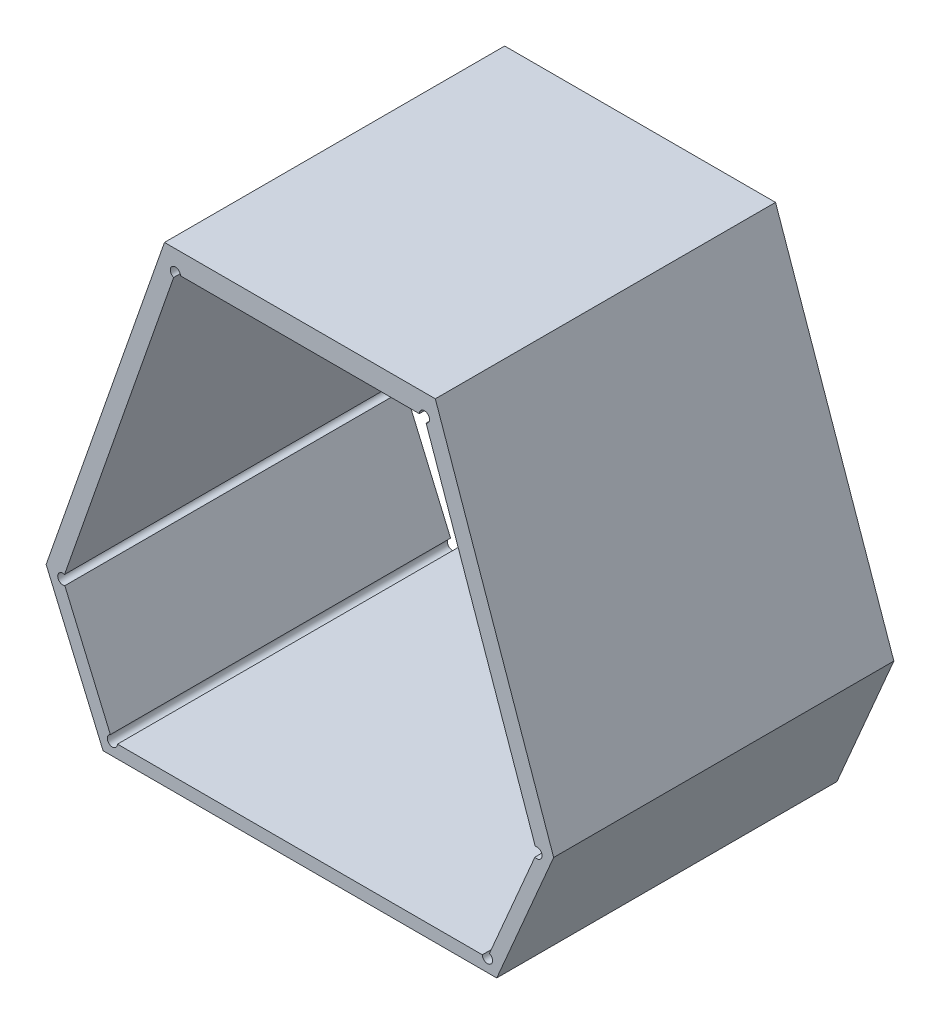
ISO-10303-21;
HEADER;
FILE_DESCRIPTION(('STEP AP214'),'2;1');
FILE_NAME('part.step','',(''),(''),'','','');
FILE_SCHEMA(('AUTOMOTIVE_DESIGN { 1 0 10303 214 1 1 1 1 }'));
ENDSEC;
DATA;
#1=APPLICATION_CONTEXT('core data for automotive mechanical design processes');
#2=APPLICATION_PROTOCOL_DEFINITION('international standard','automotive_design',2000,#1);
#3=PRODUCT_CONTEXT('',#1,'mechanical');
#4=PRODUCT('Part','Part','',(#3));
#5=PRODUCT_RELATED_PRODUCT_CATEGORY('part','',(#4));
#6=PRODUCT_DEFINITION_FORMATION('','',#4);
#7=PRODUCT_DEFINITION_CONTEXT('part definition',#1,'design');
#8=PRODUCT_DEFINITION('design','',#6,#7);
#9=PRODUCT_DEFINITION_SHAPE('','',#8);
#10=(LENGTH_UNIT() NAMED_UNIT(*) SI_UNIT(.MILLI.,.METRE.));
#11=(NAMED_UNIT(*) PLANE_ANGLE_UNIT() SI_UNIT($,.RADIAN.));
#12=(NAMED_UNIT(*) SI_UNIT($,.STERADIAN.) SOLID_ANGLE_UNIT());
#13=UNCERTAINTY_MEASURE_WITH_UNIT(LENGTH_MEASURE(1.E-05),#10,'distance_accuracy_value','');
#14=(GEOMETRIC_REPRESENTATION_CONTEXT(3) GLOBAL_UNCERTAINTY_ASSIGNED_CONTEXT((#13)) GLOBAL_UNIT_ASSIGNED_CONTEXT((#10,
#11,#12)) REPRESENTATION_CONTEXT('',''));
#15=CARTESIAN_POINT('',(0.,0.,0.));
#16=DIRECTION('',(0.,0.,1.));
#17=DIRECTION('',(1.,0.,0.));
#18=AXIS2_PLACEMENT_3D('',#15,#16,#17);
#19=CARTESIAN_POINT('',(-0.780082888944771,-0.812887620911013,0.1));
#20=DIRECTION('',(0.,0.,1.));
#21=DIRECTION('',(-1.,0.,0.));
#22=AXIS2_PLACEMENT_3D('',#19,#20,#21);
#23=CYLINDRICAL_SURFACE('',#22,0.0015);
#24=DIRECTION('',(0.,0.,1.));
#25=VECTOR('',#24,1.);
#26=CARTESIAN_POINT('',(-0.779492022647257,-0.811508897944473,0.));
#27=LINE('',#26,#25);
#28=CARTESIAN_POINT('',(-0.779492022647257,-0.811508897944473,0.));
#29=VERTEX_POINT('',#28);
#30=CARTESIAN_POINT('',(-0.779492022647257,-0.811508897944473,0.1));
#31=VERTEX_POINT('',#30);
#32=EDGE_CURVE('E11',#29,#31,#27,.T.);
#33=ORIENTED_EDGE('',*,*,#32,.F.);
#34=CARTESIAN_POINT('',(-0.780082888944771,-0.812887620911013,0.));
#35=DIRECTION('',(0.,0.,1.));
#36=DIRECTION('',(-1.,0.,0.));
#37=AXIS2_PLACEMENT_3D('',#34,#35,#36);
#38=CIRCLE('',#37,0.0015);
#39=CARTESIAN_POINT('',(-0.781582888944771,-0.812887620911013,0.));
#40=VERTEX_POINT('',#39);
#41=EDGE_CURVE('E297',#40,#29,#38,.T.);
#42=ORIENTED_EDGE('',*,*,#41,.F.);
#43=DIRECTION('',(0.,0.,-1.));
#44=VECTOR('',#43,1.);
#45=CARTESIAN_POINT('',(-0.781582888944771,-0.812887620911013,0.1));
#46=LINE('',#45,#44);
#47=CARTESIAN_POINT('',(-0.781582888944771,-0.812887620911013,0.1));
#48=VERTEX_POINT('',#47);
#49=EDGE_CURVE('E288',#48,#40,#46,.T.);
#50=ORIENTED_EDGE('',*,*,#49,.F.);
#51=CARTESIAN_POINT('',(-0.780082888944771,-0.812887620911013,0.1));
#52=DIRECTION('',(0.,0.,-1.));
#53=DIRECTION('',(0.39391086500906,0.91914864435945,0.));
#54=AXIS2_PLACEMENT_3D('',#51,#52,#53);
#55=CIRCLE('',#54,0.0015);
#56=EDGE_CURVE('E276',#31,#48,#55,.T.);
#57=ORIENTED_EDGE('',*,*,#56,.F.);
#58=EDGE_LOOP('',(#33,#42,#50,#57));
#59=FACE_BOUND('',#58,.T.);
#60=ADVANCED_FACE('F17',(#59),#23,.F.);
#61=CARTESIAN_POINT('',(-0.904883488962386,-0.778912469373211,0.1));
#62=DIRECTION('',(0.,0.,1.));
#63=DIRECTION('',(-1.,0.,0.));
#64=AXIS2_PLACEMENT_3D('',#61,#62,#63);
#65=CYLINDRICAL_SURFACE('',#64,0.0015);
#66=DIRECTION('',(0.,0.,-1.));
#67=VECTOR('',#66,1.);
#68=CARTESIAN_POINT('',(-0.90438789577797,-0.777496705482034,0.1));
#69=LINE('',#68,#67);
#70=CARTESIAN_POINT('',(-0.90438789577797,-0.777496705482034,0.1));
#71=VERTEX_POINT('',#70);
#72=CARTESIAN_POINT('',(-0.90438789577797,-0.777496705482034,0.));
#73=VERTEX_POINT('',#72);
#74=EDGE_CURVE('E24',#71,#73,#69,.T.);
#75=ORIENTED_EDGE('',*,*,#74,.F.);
#76=CARTESIAN_POINT('',(-0.904883488962386,-0.778912469373211,0.1));
#77=DIRECTION('',(0.,0.,-1.));
#78=DIRECTION('',(0.393910865009364,-0.91914864435932,0.));
#79=AXIS2_PLACEMENT_3D('',#76,#77,#78);
#80=CIRCLE('',#79,0.0015);
#81=CARTESIAN_POINT('',(-0.904292622664872,-0.78029119233975,0.1));
#82=VERTEX_POINT('',#81);
#83=EDGE_CURVE('E291',#82,#71,#80,.T.);
#84=ORIENTED_EDGE('',*,*,#83,.F.);
#85=DIRECTION('',(0.,0.,1.));
#86=VECTOR('',#85,1.);
#87=CARTESIAN_POINT('',(-0.904292622664872,-0.78029119233975,0.));
#88=LINE('',#87,#86);
#89=CARTESIAN_POINT('',(-0.904292622664872,-0.78029119233975,0.));
#90=VERTEX_POINT('',#89);
#91=EDGE_CURVE('E279',#90,#82,#88,.T.);
#92=ORIENTED_EDGE('',*,*,#91,.F.);
#93=CARTESIAN_POINT('',(-0.904883488962386,-0.778912469373211,0.));
#94=DIRECTION('',(0.,0.,1.));
#95=DIRECTION('',(0.330395456277364,0.943842594117935,0.));
#96=AXIS2_PLACEMENT_3D('',#93,#94,#95);
#97=CIRCLE('',#96,0.0015);
#98=EDGE_CURVE('E264',#73,#90,#97,.T.);
#99=ORIENTED_EDGE('',*,*,#98,.F.);
#100=EDGE_LOOP('',(#75,#84,#92,#99));
#101=FACE_BOUND('',#100,.T.);
#102=ADVANCED_FACE('F309',(#101),#65,.F.);
#103=CARTESIAN_POINT('',(-0.798601549558721,-0.684415298028327,0.1));
#104=DIRECTION('',(0.,0.,1.));
#105=DIRECTION('',(-1.,0.,0.));
#106=AXIS2_PLACEMENT_3D('',#103,#104,#105);
#107=CYLINDRICAL_SURFACE('',#106,0.0015);
#108=DIRECTION('',(0.,0.,1.));
#109=VECTOR('',#108,1.);
#110=CARTESIAN_POINT('',(-0.800101549558721,-0.684415298028327,0.));
#111=LINE('',#110,#109);
#112=CARTESIAN_POINT('',(-0.800101549558721,-0.684415298028327,0.));
#113=VERTEX_POINT('',#112);
#114=CARTESIAN_POINT('',(-0.800101549558721,-0.684415298028327,0.1));
#115=VERTEX_POINT('',#114);
#116=EDGE_CURVE('E294',#113,#115,#111,.T.);
#117=ORIENTED_EDGE('',*,*,#116,.F.);
#118=CARTESIAN_POINT('',(-0.798601549558721,-0.684415298028327,0.));
#119=DIRECTION('',(0.,0.,1.));
#120=DIRECTION('',(0.330395456277298,-0.943842594117958,0.));
#121=AXIS2_PLACEMENT_3D('',#118,#119,#120);
#122=CIRCLE('',#121,0.0015);
#123=CARTESIAN_POINT('',(-0.798105956374305,-0.685831061919504,0.));
#124=VERTEX_POINT('',#123);
#125=EDGE_CURVE('E282',#124,#113,#122,.T.);
#126=ORIENTED_EDGE('',*,*,#125,.F.);
#127=DIRECTION('',(0.,0.,-1.));
#128=VECTOR('',#127,1.);
#129=CARTESIAN_POINT('',(-0.798105956374305,-0.685831061919504,0.1));
#130=LINE('',#129,#128);
#131=CARTESIAN_POINT('',(-0.798105956374305,-0.685831061919504,0.1));
#132=VERTEX_POINT('',#131);
#133=EDGE_CURVE('E267',#132,#124,#130,.T.);
#134=ORIENTED_EDGE('',*,*,#133,.F.);
#135=CARTESIAN_POINT('',(-0.798601549558721,-0.684415298028327,0.1));
#136=DIRECTION('',(0.,0.,-1.));
#137=DIRECTION('',(-1.,0.,0.));
#138=AXIS2_PLACEMENT_3D('',#135,#136,#137);
#139=CIRCLE('',#138,0.0015);
#140=EDGE_CURVE('E252',#115,#132,#139,.T.);
#141=ORIENTED_EDGE('',*,*,#140,.F.);
#142=EDGE_LOOP('',(#117,#126,#134,#141));
#143=FACE_BOUND('',#142,.T.);
#144=ADVANCED_FACE('F330',(#143),#107,.F.);
#145=CARTESIAN_POINT('',(-0.871804418110991,-0.684415298028327,0.1));
#146=DIRECTION('',(0.,0.,1.));
#147=DIRECTION('',(-1.,0.,0.));
#148=AXIS2_PLACEMENT_3D('',#145,#146,#147);
#149=CYLINDRICAL_SURFACE('',#148,0.0015);
#150=DIRECTION('',(0.,0.,-1.));
#151=VECTOR('',#150,1.);
#152=CARTESIAN_POINT('',(-0.870304418110991,-0.684415298028327,0.1));
#153=LINE('',#152,#151);
#154=CARTESIAN_POINT('',(-0.870304418110991,-0.684415298028327,0.1));
#155=VERTEX_POINT('',#154);
#156=CARTESIAN_POINT('',(-0.870304418110991,-0.684415298028327,0.));
#157=VERTEX_POINT('',#156);
#158=EDGE_CURVE('E285',#155,#157,#153,.T.);
#159=ORIENTED_EDGE('',*,*,#158,.F.);
#160=CARTESIAN_POINT('',(-0.871804418110991,-0.684415298028327,0.1));
#161=DIRECTION('',(0.,0.,-1.));
#162=DIRECTION('',(-0.330395456277364,-0.943842594117935,0.));
#163=AXIS2_PLACEMENT_3D('',#160,#161,#162);
#164=CIRCLE('',#163,0.0015);
#165=CARTESIAN_POINT('',(-0.872300011295407,-0.685831061919504,0.1));
#166=VERTEX_POINT('',#165);
#167=EDGE_CURVE('E270',#166,#155,#164,.T.);
#168=ORIENTED_EDGE('',*,*,#167,.F.);
#169=DIRECTION('',(0.,0.,1.));
#170=VECTOR('',#169,1.);
#171=CARTESIAN_POINT('',(-0.872300011295407,-0.685831061919504,0.));
#172=LINE('',#171,#170);
#173=CARTESIAN_POINT('',(-0.872300011295407,-0.685831061919504,0.));
#174=VERTEX_POINT('',#173);
#175=EDGE_CURVE('E255',#174,#166,#172,.T.);
#176=ORIENTED_EDGE('',*,*,#175,.F.);
#177=CARTESIAN_POINT('',(-0.871804418110991,-0.684415298028327,0.));
#178=DIRECTION('',(0.,0.,1.));
#179=DIRECTION('',(1.,0.,0.));
#180=AXIS2_PLACEMENT_3D('',#177,#178,#179);
#181=CIRCLE('',#180,0.0015);
#182=EDGE_CURVE('E243',#157,#174,#181,.T.);
#183=ORIENTED_EDGE('',*,*,#182,.F.);
#184=EDGE_LOOP('',(#159,#168,#176,#183));
#185=FACE_BOUND('',#184,.T.);
#186=ADVANCED_FACE('F306',(#185),#149,.F.);
#187=CARTESIAN_POINT('',(-0.890323078724941,-0.812887620911013,0.1));
#188=DIRECTION('',(0.,0.,1.));
#189=DIRECTION('',(-1.,0.,0.));
#190=AXIS2_PLACEMENT_3D('',#187,#188,#189);
#191=CYLINDRICAL_SURFACE('',#190,0.0015);
#192=DIRECTION('',(0.,0.,1.));
#193=VECTOR('',#192,1.);
#194=CARTESIAN_POINT('',(-0.888823078724941,-0.812887620911013,0.));
#195=LINE('',#194,#193);
#196=CARTESIAN_POINT('',(-0.888823078724941,-0.812887620911013,0.));
#197=VERTEX_POINT('',#196);
#198=CARTESIAN_POINT('',(-0.888823078724941,-0.812887620911013,0.1));
#199=VERTEX_POINT('',#198);
#200=EDGE_CURVE('E273',#197,#199,#195,.T.);
#201=ORIENTED_EDGE('',*,*,#200,.F.);
#202=CARTESIAN_POINT('',(-0.890323078724941,-0.812887620911013,0.));
#203=DIRECTION('',(0.,0.,1.));
#204=DIRECTION('',(-0.393910865009122,0.919148644359423,0.));
#205=AXIS2_PLACEMENT_3D('',#202,#203,#204);
#206=CIRCLE('',#205,0.0015);
#207=CARTESIAN_POINT('',(-0.890913945022455,-0.811508897944473,0.));
#208=VERTEX_POINT('',#207);
#209=EDGE_CURVE('E258',#208,#197,#206,.T.);
#210=ORIENTED_EDGE('',*,*,#209,.F.);
#211=DIRECTION('',(0.,0.,-1.));
#212=VECTOR('',#211,1.);
#213=CARTESIAN_POINT('',(-0.890913945022455,-0.811508897944473,0.1));
#214=LINE('',#213,#212);
#215=CARTESIAN_POINT('',(-0.890913945022455,-0.811508897944473,0.1));
#216=VERTEX_POINT('',#215);
#217=EDGE_CURVE('E246',#216,#208,#214,.T.);
#218=ORIENTED_EDGE('',*,*,#217,.F.);
#219=CARTESIAN_POINT('',(-0.890323078724941,-0.812887620911013,0.1));
#220=DIRECTION('',(0.,0.,-1.));
#221=DIRECTION('',(1.,0.,0.));
#222=AXIS2_PLACEMENT_3D('',#219,#220,#221);
#223=CIRCLE('',#222,0.0015);
#224=EDGE_CURVE('E234',#199,#216,#223,.T.);
#225=ORIENTED_EDGE('',*,*,#224,.F.);
#226=EDGE_LOOP('',(#201,#210,#218,#225));
#227=FACE_BOUND('',#226,.T.);
#228=ADVANCED_FACE('F315',(#227),#191,.F.);
#229=CARTESIAN_POINT('',(-0.765522478707326,-0.778912469373211,0.1));
#230=DIRECTION('',(0.,0.,1.));
#231=DIRECTION('',(-1.,0.,0.));
#232=AXIS2_PLACEMENT_3D('',#229,#230,#231);
#233=CYLINDRICAL_SURFACE('',#232,0.0015);
#234=DIRECTION('',(0.,0.,1.));
#235=VECTOR('',#234,1.);
#236=CARTESIAN_POINT('',(-0.766018071891742,-0.777496705482034,0.));
#237=LINE('',#236,#235);
#238=CARTESIAN_POINT('',(-0.766018071891742,-0.777496705482034,0.));
#239=VERTEX_POINT('',#238);
#240=CARTESIAN_POINT('',(-0.766018071891742,-0.777496705482034,0.1));
#241=VERTEX_POINT('',#240);
#242=EDGE_CURVE('E261',#239,#241,#237,.T.);
#243=ORIENTED_EDGE('',*,*,#242,.F.);
#244=CARTESIAN_POINT('',(-0.765522478707326,-0.778912469373211,0.));
#245=DIRECTION('',(0.,0.,1.));
#246=DIRECTION('',(-0.393910865009274,-0.919148644359358,0.));
#247=AXIS2_PLACEMENT_3D('',#244,#245,#246);
#248=CIRCLE('',#247,0.0015);
#249=CARTESIAN_POINT('',(-0.76611334500484,-0.78029119233975,0.));
#250=VERTEX_POINT('',#249);
#251=EDGE_CURVE('E249',#250,#239,#248,.T.);
#252=ORIENTED_EDGE('',*,*,#251,.F.);
#253=DIRECTION('',(0.,0.,-1.));
#254=VECTOR('',#253,1.);
#255=CARTESIAN_POINT('',(-0.76611334500484,-0.78029119233975,0.1));
#256=LINE('',#255,#254);
#257=CARTESIAN_POINT('',(-0.76611334500484,-0.78029119233975,0.1));
#258=VERTEX_POINT('',#257);
#259=EDGE_CURVE('E237',#258,#250,#256,.T.);
#260=ORIENTED_EDGE('',*,*,#259,.F.);
#261=CARTESIAN_POINT('',(-0.765522478707326,-0.778912469373211,0.1));
#262=DIRECTION('',(0.,0.,-1.));
#263=DIRECTION('',(-0.330395456277298,0.943842594117958,0.));
#264=AXIS2_PLACEMENT_3D('',#261,#262,#263);
#265=CIRCLE('',#264,0.0015);
#266=EDGE_CURVE('E226',#241,#258,#265,.T.);
#267=ORIENTED_EDGE('',*,*,#266,.F.);
#268=EDGE_LOOP('',(#243,#252,#260,#267));
#269=FACE_BOUND('',#268,.T.);
#270=ADVANCED_FACE('F324',(#269),#233,.F.);
#271=CARTESIAN_POINT('',(-0.904883488962386,-0.778912469373211,0.));
#272=DIRECTION('',(-0.919148644359503,-0.393910865008936,0.));
#273=DIRECTION('',(0.393910865008936,-0.919148644359503,0.));
#274=AXIS2_PLACEMENT_3D('',#271,#272,#273);
#275=PLANE('',#274);
#276=ORIENTED_EDGE('',*,*,#91,.T.);
#277=DIRECTION('',(0.393910865008931,-0.919148644359505,0.));
#278=VECTOR('',#277,1.);
#279=CARTESIAN_POINT('',(-0.904292622664873,-0.78029119233975,0.1));
#280=LINE('',#279,#278);
#281=EDGE_CURVE('E240',#82,#216,#280,.T.);
#282=ORIENTED_EDGE('',*,*,#281,.T.);
#283=ORIENTED_EDGE('',*,*,#217,.T.);
#284=DIRECTION('',(0.393910865008931,-0.919148644359505,0.));
#285=VECTOR('',#284,1.);
#286=CARTESIAN_POINT('',(-0.904292622664873,-0.78029119233975,0.));
#287=LINE('',#286,#285);
#288=EDGE_CURVE('E220',#90,#208,#287,.T.);
#289=ORIENTED_EDGE('',*,*,#288,.F.);
#290=EDGE_LOOP('',(#276,#282,#283,#289));
#291=FACE_BOUND('',#290,.T.);
#292=ADVANCED_FACE('F312',(#291),#275,.F.);
#293=CARTESIAN_POINT('',(-0.780082888944771,-0.812887620911013,0.));
#294=DIRECTION('',(0.,1.,0.));
#295=DIRECTION('',(-1.,0.,0.));
#296=AXIS2_PLACEMENT_3D('',#293,#294,#295);
#297=PLANE('',#296);
#298=ORIENTED_EDGE('',*,*,#49,.T.);
#299=DIRECTION('',(-1.,0.,0.));
#300=VECTOR('',#299,1.);
#301=CARTESIAN_POINT('',(-0.781582888944771,-0.812887620911013,0.));
#302=LINE('',#301,#300);
#303=EDGE_CURVE('E229',#40,#197,#302,.T.);
#304=ORIENTED_EDGE('',*,*,#303,.T.);
#305=ORIENTED_EDGE('',*,*,#200,.T.);
#306=DIRECTION('',(-1.,0.,0.));
#307=VECTOR('',#306,1.);
#308=CARTESIAN_POINT('',(-0.781582888944771,-0.812887620911013,0.1));
#309=LINE('',#308,#307);
#310=EDGE_CURVE('E206',#48,#199,#309,.T.);
#311=ORIENTED_EDGE('',*,*,#310,.F.);
#312=EDGE_LOOP('',(#298,#304,#305,#311));
#313=FACE_BOUND('',#312,.T.);
#314=ADVANCED_FACE('F318',(#313),#297,.T.);
#315=CARTESIAN_POINT('',(-0.791589118036377,-0.75296828989425,0.));
#316=DIRECTION('',(0.,0.,1.));
#317=DIRECTION('',(1.,0.,0.));
#318=AXIS2_PLACEMENT_3D('',#315,#316,#317);
#319=PLANE('',#318);
#320=DIRECTION('',(-1.,0.,0.));
#321=VECTOR('',#320,1.);
#322=CARTESIAN_POINT('',(-0.795398663242687,-0.678272156526781,0.));
#323=LINE('',#322,#321);
#324=CARTESIAN_POINT('',(-0.795398663242687,-0.678272156526781,0.));
#325=VERTEX_POINT('',#324);
#326=CARTESIAN_POINT('',(-0.875007304427025,-0.678272156526781,0.));
#327=VERTEX_POINT('',#326);
#328=EDGE_CURVE('E232',#325,#327,#323,.T.);
#329=ORIENTED_EDGE('',*,*,#328,.F.);
#330=DIRECTION('',(-0.33039545627716,0.943842594118006,0.));
#331=VECTOR('',#330,1.);
#332=CARTESIAN_POINT('',(-0.760615005145567,-0.777638832028998,0.));
#333=LINE('',#332,#331);
#334=CARTESIAN_POINT('',(-0.760615005145567,-0.777638832028998,0.));
#335=VERTEX_POINT('',#334);
#336=EDGE_CURVE('E223',#335,#325,#333,.T.);
#337=ORIENTED_EDGE('',*,*,#336,.F.);
#338=DIRECTION('',(0.393910865008936,0.919148644359503,0.));
#339=VECTOR('',#338,1.);
#340=CARTESIAN_POINT('',(-0.777350181276223,-0.816688565915523,0.));
#341=LINE('',#340,#339);
#342=CARTESIAN_POINT('',(-0.777350181276223,-0.816688565915523,0.));
#343=VERTEX_POINT('',#342);
#344=EDGE_CURVE('E212',#343,#335,#341,.T.);
#345=ORIENTED_EDGE('',*,*,#344,.F.);
#346=DIRECTION('',(-1.,0.,0.));
#347=VECTOR('',#346,1.);
#348=CARTESIAN_POINT('',(-0.777350181276223,-0.816688565915523,0.));
#349=LINE('',#348,#347);
#350=CARTESIAN_POINT('',(-0.893055786393489,-0.816688565915523,0.));
#351=VERTEX_POINT('',#350);
#352=EDGE_CURVE('E147',#343,#351,#349,.T.);
#353=ORIENTED_EDGE('',*,*,#352,.T.);
#354=DIRECTION('',(-0.393910865008938,0.919148644359502,0.));
#355=VECTOR('',#354,1.);
#356=CARTESIAN_POINT('',(-0.893055786393489,-0.816688565915523,0.));
#357=LINE('',#356,#355);
#358=CARTESIAN_POINT('',(-0.909790962524145,-0.777638832028998,0.));
#359=VERTEX_POINT('',#358);
#360=EDGE_CURVE('E203',#351,#359,#357,.T.);
#361=ORIENTED_EDGE('',*,*,#360,.T.);
#362=DIRECTION('',(0.33039545627716,0.943842594118006,0.));
#363=VECTOR('',#362,1.);
#364=CARTESIAN_POINT('',(-0.909790962524145,-0.777638832028998,0.));
#365=LINE('',#364,#363);
#366=EDGE_CURVE('E217',#359,#327,#365,.T.);
#367=ORIENTED_EDGE('',*,*,#366,.T.);
#368=EDGE_LOOP('',(#329,#337,#345,#353,#361,#367));
#369=FACE_BOUND('',#368,.T.);
#370=ORIENTED_EDGE('',*,*,#41,.T.);
#371=DIRECTION('',(-0.393910865008934,-0.919148644359504,0.));
#372=VECTOR('',#371,1.);
#373=CARTESIAN_POINT('',(-0.766113345004839,-0.78029119233975,0.));
#374=LINE('',#373,#372);
#375=EDGE_CURVE('E209',#250,#29,#374,.T.);
#376=ORIENTED_EDGE('',*,*,#375,.F.);
#377=ORIENTED_EDGE('',*,*,#251,.T.);
#378=DIRECTION('',(0.330395456277161,-0.943842594118006,0.));
#379=VECTOR('',#378,1.);
#380=CARTESIAN_POINT('',(-0.798105956374305,-0.685831061919504,0.));
#381=LINE('',#380,#379);
#382=EDGE_CURVE('E214',#124,#239,#381,.T.);
#383=ORIENTED_EDGE('',*,*,#382,.F.);
#384=ORIENTED_EDGE('',*,*,#125,.T.);
#385=DIRECTION('',(1.,0.,0.));
#386=VECTOR('',#385,1.);
#387=CARTESIAN_POINT('',(-0.870304418110991,-0.684415298028327,0.));
#388=LINE('',#387,#386);
#389=EDGE_CURVE('E183',#157,#113,#388,.T.);
#390=ORIENTED_EDGE('',*,*,#389,.F.);
#391=ORIENTED_EDGE('',*,*,#182,.T.);
#392=DIRECTION('',(-0.33039545627716,-0.943842594118006,0.));
#393=VECTOR('',#392,1.);
#394=CARTESIAN_POINT('',(-0.872300011295407,-0.685831061919504,0.));
#395=LINE('',#394,#393);
#396=EDGE_CURVE('E190',#174,#73,#395,.T.);
#397=ORIENTED_EDGE('',*,*,#396,.T.);
#398=ORIENTED_EDGE('',*,*,#98,.T.);
#399=ORIENTED_EDGE('',*,*,#288,.T.);
#400=ORIENTED_EDGE('',*,*,#209,.T.);
#401=ORIENTED_EDGE('',*,*,#303,.F.);
#402=EDGE_LOOP('',(#370,#376,#377,#383,#384,#390,#391,#397,#398,#399,#400,#401));
#403=FACE_BOUND('',#402,.T.);
#404=ADVANCED_FACE('F303',(#369,#403),#319,.F.);
#405=CARTESIAN_POINT('',(-0.798601549558721,-0.684415298028327,0.));
#406=DIRECTION('',(-0.943842594118006,-0.33039545627716,0.));
#407=DIRECTION('',(0.33039545627716,-0.943842594118006,0.));
#408=AXIS2_PLACEMENT_3D('',#405,#406,#407);
#409=PLANE('',#408);
#410=ORIENTED_EDGE('',*,*,#133,.T.);
#411=ORIENTED_EDGE('',*,*,#382,.T.);
#412=ORIENTED_EDGE('',*,*,#242,.T.);
#413=DIRECTION('',(0.330395456277161,-0.943842594118006,0.));
#414=VECTOR('',#413,1.);
#415=CARTESIAN_POINT('',(-0.798105956374305,-0.685831061919504,0.1));
#416=LINE('',#415,#414);
#417=EDGE_CURVE('E193',#132,#241,#416,.T.);
#418=ORIENTED_EDGE('',*,*,#417,.F.);
#419=EDGE_LOOP('',(#410,#411,#412,#418));
#420=FACE_BOUND('',#419,.T.);
#421=ADVANCED_FACE('F327',(#420),#409,.T.);
#422=CARTESIAN_POINT('',(-0.909790962524145,-0.777638832028998,0.));
#423=DIRECTION('',(0.943842594118006,-0.33039545627716,0.));
#424=DIRECTION('',(0.33039545627716,0.943842594118006,0.));
#425=AXIS2_PLACEMENT_3D('',#422,#423,#424);
#426=PLANE('',#425);
#427=ORIENTED_EDGE('',*,*,#366,.F.);
#428=DIRECTION('',(0.,0.,1.));
#429=VECTOR('',#428,1.);
#430=CARTESIAN_POINT('',(-0.909790962524145,-0.777638832028998,0.));
#431=LINE('',#430,#429);
#432=CARTESIAN_POINT('',(-0.909790962524145,-0.777638832028998,0.1));
#433=VERTEX_POINT('',#432);
#434=EDGE_CURVE('E201',#359,#433,#431,.T.);
#435=ORIENTED_EDGE('',*,*,#434,.T.);
#436=DIRECTION('',(0.33039545627716,0.943842594118006,0.));
#437=VECTOR('',#436,1.);
#438=CARTESIAN_POINT('',(-0.909790962524145,-0.777638832028998,0.1));
#439=LINE('',#438,#437);
#440=CARTESIAN_POINT('',(-0.875007304427025,-0.678272156526781,0.1));
#441=VERTEX_POINT('',#440);
#442=EDGE_CURVE('E196',#433,#441,#439,.T.);
#443=ORIENTED_EDGE('',*,*,#442,.T.);
#444=DIRECTION('',(0.,0.,1.));
#445=VECTOR('',#444,1.);
#446=CARTESIAN_POINT('',(-0.875007304427025,-0.678272156526781,0.));
#447=LINE('',#446,#445);
#448=EDGE_CURVE('E186',#327,#441,#447,.T.);
#449=ORIENTED_EDGE('',*,*,#448,.F.);
#450=EDGE_LOOP('',(#427,#435,#443,#449));
#451=FACE_BOUND('',#450,.T.);
#452=ADVANCED_FACE('F447',(#451),#426,.F.);
#453=CARTESIAN_POINT('',(-0.893055786393489,-0.816688565915523,0.));
#454=DIRECTION('',(0.919148644359502,0.393910865008938,0.));
#455=DIRECTION('',(-0.393910865008938,0.919148644359502,0.));
#456=AXIS2_PLACEMENT_3D('',#453,#454,#455);
#457=PLANE('',#456);
#458=ORIENTED_EDGE('',*,*,#360,.F.);
#459=DIRECTION('',(0.,0.,1.));
#460=VECTOR('',#459,1.);
#461=CARTESIAN_POINT('',(-0.893055786393489,-0.816688565915523,0.));
#462=LINE('',#461,#460);
#463=CARTESIAN_POINT('',(-0.893055786393489,-0.816688565915523,0.1));
#464=VERTEX_POINT('',#463);
#465=EDGE_CURVE('E198',#351,#464,#462,.T.);
#466=ORIENTED_EDGE('',*,*,#465,.T.);
#467=DIRECTION('',(-0.393910865008938,0.919148644359502,0.));
#468=VECTOR('',#467,1.);
#469=CARTESIAN_POINT('',(-0.893055786393489,-0.816688565915523,0.1));
#470=LINE('',#469,#468);
#471=EDGE_CURVE('E167',#464,#433,#470,.T.);
#472=ORIENTED_EDGE('',*,*,#471,.T.);
#473=ORIENTED_EDGE('',*,*,#434,.F.);
#474=EDGE_LOOP('',(#458,#466,#472,#473));
#475=FACE_BOUND('',#474,.T.);
#476=ADVANCED_FACE('F355',(#475),#457,.F.);
#477=CARTESIAN_POINT('',(-0.871804418110991,-0.684415298028327,0.));
#478=DIRECTION('',(-0.943842594118006,0.33039545627716,0.));
#479=DIRECTION('',(-0.33039545627716,-0.943842594118006,0.));
#480=AXIS2_PLACEMENT_3D('',#477,#478,#479);
#481=PLANE('',#480);
#482=ORIENTED_EDGE('',*,*,#74,.T.);
#483=ORIENTED_EDGE('',*,*,#396,.F.);
#484=ORIENTED_EDGE('',*,*,#175,.T.);
#485=DIRECTION('',(-0.33039545627716,-0.943842594118006,0.));
#486=VECTOR('',#485,1.);
#487=CARTESIAN_POINT('',(-0.872300011295407,-0.685831061919504,0.1));
#488=LINE('',#487,#486);
#489=EDGE_CURVE('E177',#166,#71,#488,.T.);
#490=ORIENTED_EDGE('',*,*,#489,.T.);
#491=EDGE_LOOP('',(#482,#483,#484,#490));
#492=FACE_BOUND('',#491,.T.);
#493=ADVANCED_FACE('F300',(#492),#481,.F.);
#494=CARTESIAN_POINT('',(-0.795398663242687,-0.678272156526781,0.));
#495=DIRECTION('',(0.,1.,0.));
#496=DIRECTION('',(-1.,0.,0.));
#497=AXIS2_PLACEMENT_3D('',#494,#495,#496);
#498=PLANE('',#497);
#499=ORIENTED_EDGE('',*,*,#328,.T.);
#500=ORIENTED_EDGE('',*,*,#448,.T.);
#501=DIRECTION('',(-1.,0.,0.));
#502=VECTOR('',#501,1.);
#503=CARTESIAN_POINT('',(-0.795398663242687,-0.678272156526781,0.1));
#504=LINE('',#503,#502);
#505=CARTESIAN_POINT('',(-0.795398663242687,-0.678272156526781,0.1));
#506=VERTEX_POINT('',#505);
#507=EDGE_CURVE('E179',#506,#441,#504,.T.);
#508=ORIENTED_EDGE('',*,*,#507,.F.);
#509=DIRECTION('',(0.,0.,1.));
#510=VECTOR('',#509,1.);
#511=CARTESIAN_POINT('',(-0.795398663242687,-0.678272156526781,0.));
#512=LINE('',#511,#510);
#513=EDGE_CURVE('E181',#325,#506,#512,.T.);
#514=ORIENTED_EDGE('',*,*,#513,.F.);
#515=EDGE_LOOP('',(#499,#500,#508,#514));
#516=FACE_BOUND('',#515,.T.);
#517=ADVANCED_FACE('F354',(#516),#498,.T.);
#518=CARTESIAN_POINT('',(-0.760615005145567,-0.777638832028998,0.));
#519=DIRECTION('',(0.943842594118006,0.33039545627716,0.));
#520=DIRECTION('',(-0.33039545627716,0.943842594118006,0.));
#521=AXIS2_PLACEMENT_3D('',#518,#519,#520);
#522=PLANE('',#521);
#523=ORIENTED_EDGE('',*,*,#336,.T.);
#524=ORIENTED_EDGE('',*,*,#513,.T.);
#525=DIRECTION('',(-0.33039545627716,0.943842594118006,0.));
#526=VECTOR('',#525,1.);
#527=CARTESIAN_POINT('',(-0.760615005145567,-0.777638832028998,0.1));
#528=LINE('',#527,#526);
#529=CARTESIAN_POINT('',(-0.760615005145567,-0.777638832028998,0.1));
#530=VERTEX_POINT('',#529);
#531=EDGE_CURVE('E150',#530,#506,#528,.T.);
#532=ORIENTED_EDGE('',*,*,#531,.F.);
#533=DIRECTION('',(0.,0.,1.));
#534=VECTOR('',#533,1.);
#535=CARTESIAN_POINT('',(-0.760615005145567,-0.777638832028998,0.));
#536=LINE('',#535,#534);
#537=EDGE_CURVE('E156',#335,#530,#536,.T.);
#538=ORIENTED_EDGE('',*,*,#537,.F.);
#539=EDGE_LOOP('',(#523,#524,#532,#538));
#540=FACE_BOUND('',#539,.T.);
#541=ADVANCED_FACE('F480',(#540),#522,.T.);
#542=CARTESIAN_POINT('',(-0.777350181276223,-0.816688565915523,0.));
#543=DIRECTION('',(0.919148644359502,-0.393910865008938,0.));
#544=DIRECTION('',(0.393910865008938,0.919148644359502,0.));
#545=AXIS2_PLACEMENT_3D('',#542,#543,#544);
#546=PLANE('',#545);
#547=ORIENTED_EDGE('',*,*,#344,.T.);
#548=ORIENTED_EDGE('',*,*,#537,.T.);
#549=DIRECTION('',(0.393910865008936,0.919148644359503,0.));
#550=VECTOR('',#549,1.);
#551=CARTESIAN_POINT('',(-0.777350181276223,-0.816688565915523,0.1));
#552=LINE('',#551,#550);
#553=CARTESIAN_POINT('',(-0.777350181276223,-0.816688565915523,0.1));
#554=VERTEX_POINT('',#553);
#555=EDGE_CURVE('E151',#554,#530,#552,.T.);
#556=ORIENTED_EDGE('',*,*,#555,.F.);
#557=DIRECTION('',(0.,0.,1.));
#558=VECTOR('',#557,1.);
#559=CARTESIAN_POINT('',(-0.777350181276223,-0.816688565915523,0.));
#560=LINE('',#559,#558);
#561=EDGE_CURVE('E139',#343,#554,#560,.T.);
#562=ORIENTED_EDGE('',*,*,#561,.F.);
#563=EDGE_LOOP('',(#547,#548,#556,#562));
#564=FACE_BOUND('',#563,.T.);
#565=ADVANCED_FACE('F154',(#564),#546,.T.);
#566=CARTESIAN_POINT('',(-0.835202983834856,-0.816688565915523,0.));
#567=DIRECTION('',(0.,-1.,0.));
#568=DIRECTION('',(1.,0.,0.));
#569=AXIS2_PLACEMENT_3D('',#566,#567,#568);
#570=PLANE('',#569);
#571=ORIENTED_EDGE('',*,*,#352,.F.);
#572=ORIENTED_EDGE('',*,*,#561,.T.);
#573=DIRECTION('',(-1.,0.,0.));
#574=VECTOR('',#573,1.);
#575=CARTESIAN_POINT('',(-0.777350181276223,-0.816688565915523,0.1));
#576=LINE('',#575,#574);
#577=EDGE_CURVE('E144',#554,#464,#576,.T.);
#578=ORIENTED_EDGE('',*,*,#577,.T.);
#579=ORIENTED_EDGE('',*,*,#465,.F.);
#580=EDGE_LOOP('',(#571,#572,#578,#579));
#581=FACE_BOUND('',#580,.T.);
#582=ADVANCED_FACE('F141',(#581),#570,.T.);
#583=CARTESIAN_POINT('',(-0.765522478707326,-0.778912469373211,0.));
#584=DIRECTION('',(-0.919148644359503,0.393910865008936,0.));
#585=DIRECTION('',(-0.393910865008936,-0.919148644359503,0.));
#586=AXIS2_PLACEMENT_3D('',#583,#584,#585);
#587=PLANE('',#586);
#588=ORIENTED_EDGE('',*,*,#32,.T.);
#589=DIRECTION('',(-0.393910865008934,-0.919148644359504,0.));
#590=VECTOR('',#589,1.);
#591=CARTESIAN_POINT('',(-0.766113345004839,-0.78029119233975,0.1));
#592=LINE('',#591,#590);
#593=EDGE_CURVE('E160',#258,#31,#592,.T.);
#594=ORIENTED_EDGE('',*,*,#593,.F.);
#595=ORIENTED_EDGE('',*,*,#259,.T.);
#596=ORIENTED_EDGE('',*,*,#375,.T.);
#597=EDGE_LOOP('',(#588,#594,#595,#596));
#598=FACE_BOUND('',#597,.T.);
#599=ADVANCED_FACE('F321',(#598),#587,.T.);
#600=CARTESIAN_POINT('',(-0.835202983834856,-0.684415298028327,0.));
#601=DIRECTION('',(0.,-1.,0.));
#602=DIRECTION('',(1.,0.,0.));
#603=AXIS2_PLACEMENT_3D('',#600,#601,#602);
#604=PLANE('',#603);
#605=ORIENTED_EDGE('',*,*,#116,.T.);
#606=DIRECTION('',(-1.,0.,0.));
#607=VECTOR('',#606,1.);
#608=CARTESIAN_POINT('',(-0.800101549558721,-0.684415298028327,0.1));
#609=LINE('',#608,#607);
#610=EDGE_CURVE('E168',#115,#155,#609,.T.);
#611=ORIENTED_EDGE('',*,*,#610,.T.);
#612=ORIENTED_EDGE('',*,*,#158,.T.);
#613=ORIENTED_EDGE('',*,*,#389,.T.);
#614=EDGE_LOOP('',(#605,#611,#612,#613));
#615=FACE_BOUND('',#614,.T.);
#616=ADVANCED_FACE('F332',(#615),#604,.T.);
#617=CARTESIAN_POINT('',(-0.791589118036377,-0.75296828989425,0.1));
#618=DIRECTION('',(0.,0.,1.));
#619=DIRECTION('',(1.,0.,0.));
#620=AXIS2_PLACEMENT_3D('',#617,#618,#619);
#621=PLANE('',#620);
#622=ORIENTED_EDGE('',*,*,#507,.T.);
#623=ORIENTED_EDGE('',*,*,#442,.F.);
#624=ORIENTED_EDGE('',*,*,#471,.F.);
#625=ORIENTED_EDGE('',*,*,#577,.F.);
#626=ORIENTED_EDGE('',*,*,#555,.T.);
#627=ORIENTED_EDGE('',*,*,#531,.T.);
#628=EDGE_LOOP('',(#622,#623,#624,#625,#626,#627));
#629=FACE_BOUND('',#628,.T.);
#630=ORIENTED_EDGE('',*,*,#56,.T.);
#631=ORIENTED_EDGE('',*,*,#310,.T.);
#632=ORIENTED_EDGE('',*,*,#224,.T.);
#633=ORIENTED_EDGE('',*,*,#281,.F.);
#634=ORIENTED_EDGE('',*,*,#83,.T.);
#635=ORIENTED_EDGE('',*,*,#489,.F.);
#636=ORIENTED_EDGE('',*,*,#167,.T.);
#637=ORIENTED_EDGE('',*,*,#610,.F.);
#638=ORIENTED_EDGE('',*,*,#140,.T.);
#639=ORIENTED_EDGE('',*,*,#417,.T.);
#640=ORIENTED_EDGE('',*,*,#266,.T.);
#641=ORIENTED_EDGE('',*,*,#593,.T.);
#642=EDGE_LOOP('',(#630,#631,#632,#633,#634,#635,#636,#637,#638,#639,#640,#641));
#643=FACE_BOUND('',#642,.T.);
#644=ADVANCED_FACE('F163',(#629,#643),#621,.T.);
#645=CLOSED_SHELL('',(#60,#102,#144,#186,#228,#270,#292,#314,#404,#421,#452,#476,#493,#517,#541,
#565,#582,#599,#616,#644));
#646=MANIFOLD_SOLID_BREP('B1',#645);
#647=ADVANCED_BREP_SHAPE_REPRESENTATION('',(#18,#646),#14);
#648=SHAPE_DEFINITION_REPRESENTATION(#9,#647);
ENDSEC;
END-ISO-10303-21;
